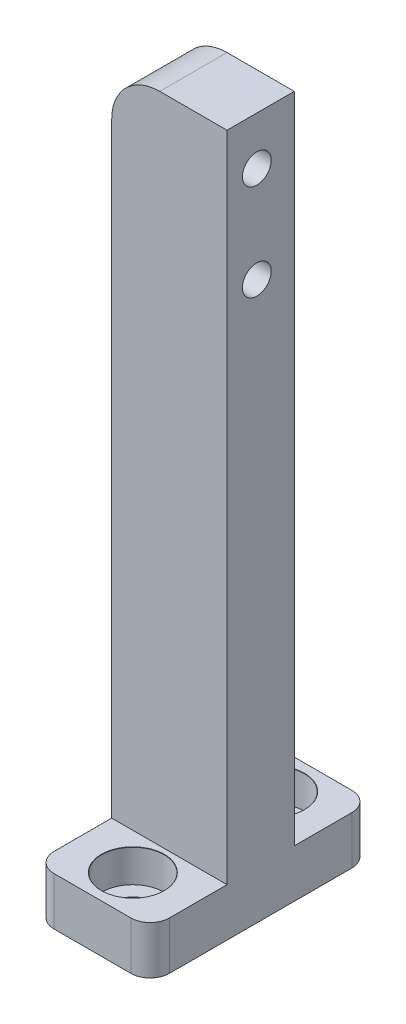
ISO-10303-21;
HEADER;
FILE_DESCRIPTION(('STEP AP214'),'2;1');
FILE_NAME('part.step','',(''),(''),'','','');
FILE_SCHEMA(('AUTOMOTIVE_DESIGN { 1 0 10303 214 1 1 1 1 }'));
ENDSEC;
DATA;
#1=APPLICATION_CONTEXT('core data for automotive mechanical design processes');
#2=APPLICATION_PROTOCOL_DEFINITION('international standard','automotive_design',2000,#1);
#3=PRODUCT_CONTEXT('',#1,'mechanical');
#4=PRODUCT('Part','Part','',(#3));
#5=PRODUCT_RELATED_PRODUCT_CATEGORY('part','',(#4));
#6=PRODUCT_DEFINITION_FORMATION('','',#4);
#7=PRODUCT_DEFINITION_CONTEXT('part definition',#1,'design');
#8=PRODUCT_DEFINITION('design','',#6,#7);
#9=PRODUCT_DEFINITION_SHAPE('','',#8);
#10=(LENGTH_UNIT() NAMED_UNIT(*) SI_UNIT(.MILLI.,.METRE.));
#11=(NAMED_UNIT(*) PLANE_ANGLE_UNIT() SI_UNIT($,.RADIAN.));
#12=(NAMED_UNIT(*) SI_UNIT($,.STERADIAN.) SOLID_ANGLE_UNIT());
#13=UNCERTAINTY_MEASURE_WITH_UNIT(LENGTH_MEASURE(1.E-05),#10,'distance_accuracy_value','');
#14=(GEOMETRIC_REPRESENTATION_CONTEXT(3) GLOBAL_UNCERTAINTY_ASSIGNED_CONTEXT((#13)) GLOBAL_UNIT_ASSIGNED_CONTEXT((#10,
#11,#12)) REPRESENTATION_CONTEXT('',''));
#15=CARTESIAN_POINT('',(0.,0.,0.));
#16=DIRECTION('',(0.,0.,1.));
#17=DIRECTION('',(1.,0.,0.));
#18=AXIS2_PLACEMENT_3D('',#15,#16,#17);
#19=CARTESIAN_POINT('',(-6.,36.5,-3.5));
#20=DIRECTION('',(0.,0.,1.));
#21=DIRECTION('',(1.,0.,0.));
#22=AXIS2_PLACEMENT_3D('',#19,#20,#21);
#23=PLANE('',#22);
#24=DIRECTION('',(0.,-1.,0.));
#25=VECTOR('',#24,1.);
#26=CARTESIAN_POINT('',(-6.,36.5,-3.5));
#27=LINE('',#26,#25);
#28=CARTESIAN_POINT('',(-6.,31.5,-3.5));
#29=VERTEX_POINT('',#28);
#30=CARTESIAN_POINT('',(-6.,-31.5,-3.5));
#31=VERTEX_POINT('',#30);
#32=EDGE_CURVE('E231',#29,#31,#27,.T.);
#33=ORIENTED_EDGE('',*,*,#32,.F.);
#34=CARTESIAN_POINT('',(-1.,31.5,-3.5));
#35=DIRECTION('',(0.,0.,1.));
#36=DIRECTION('',(1.,0.,0.));
#37=AXIS2_PLACEMENT_3D('',#34,#35,#36);
#38=CIRCLE('',#37,5.);
#39=CARTESIAN_POINT('',(-1.,36.5,-3.5));
#40=VERTEX_POINT('',#39);
#41=EDGE_CURVE('E11',#29,#40,#38,.F.);
#42=ORIENTED_EDGE('',*,*,#41,.T.);
#43=DIRECTION('',(-1.,0.,0.));
#44=VECTOR('',#43,1.);
#45=CARTESIAN_POINT('',(-6.,36.5,-3.5));
#46=LINE('',#45,#44);
#47=CARTESIAN_POINT('',(6.,36.5,-3.5));
#48=VERTEX_POINT('',#47);
#49=EDGE_CURVE('E254',#48,#40,#46,.T.);
#50=ORIENTED_EDGE('',*,*,#49,.F.);
#51=DIRECTION('',(0.,-1.,0.));
#52=VECTOR('',#51,1.);
#53=CARTESIAN_POINT('',(6.,36.5,-3.5));
#54=LINE('',#53,#52);
#55=CARTESIAN_POINT('',(6.,-31.5,-3.5));
#56=VERTEX_POINT('',#55);
#57=EDGE_CURVE('E228',#48,#56,#54,.T.);
#58=ORIENTED_EDGE('',*,*,#57,.T.);
#59=DIRECTION('',(1.,0.,0.));
#60=VECTOR('',#59,1.);
#61=CARTESIAN_POINT('',(-5.99999999999996,-31.5,-3.5));
#62=LINE('',#61,#60);
#63=EDGE_CURVE('E251',#31,#56,#62,.T.);
#64=ORIENTED_EDGE('',*,*,#63,.F.);
#65=EDGE_LOOP('',(#33,#42,#50,#58,#64));
#66=FACE_BOUND('',#65,.T.);
#67=ADVANCED_FACE('F46',(#66),#23,.F.);
#68=CARTESIAN_POINT('',(-6.,36.5,3.5));
#69=DIRECTION('',(0.,0.,-1.));
#70=DIRECTION('',(-1.,0.,0.));
#71=AXIS2_PLACEMENT_3D('',#68,#69,#70);
#72=PLANE('',#71);
#73=DIRECTION('',(1.,0.,0.));
#74=VECTOR('',#73,1.);
#75=CARTESIAN_POINT('',(-6.,36.5,3.5));
#76=LINE('',#75,#74);
#77=CARTESIAN_POINT('',(-1.,36.5,3.5));
#78=VERTEX_POINT('',#77);
#79=CARTESIAN_POINT('',(6.,36.5,3.5));
#80=VERTEX_POINT('',#79);
#81=EDGE_CURVE('E241',#78,#80,#76,.T.);
#82=ORIENTED_EDGE('',*,*,#81,.F.);
#83=CARTESIAN_POINT('',(-1.,31.5,3.5));
#84=DIRECTION('',(0.,0.,-1.));
#85=DIRECTION('',(-1.,0.,0.));
#86=AXIS2_PLACEMENT_3D('',#83,#84,#85);
#87=CIRCLE('',#86,5.);
#88=CARTESIAN_POINT('',(-6.,31.5,3.5));
#89=VERTEX_POINT('',#88);
#90=EDGE_CURVE('E160',#78,#89,#87,.F.);
#91=ORIENTED_EDGE('',*,*,#90,.T.);
#92=DIRECTION('',(0.,-1.,0.));
#93=VECTOR('',#92,1.);
#94=CARTESIAN_POINT('',(-6.,36.5,3.5));
#95=LINE('',#94,#93);
#96=CARTESIAN_POINT('',(-6.,-31.5,3.5));
#97=VERTEX_POINT('',#96);
#98=EDGE_CURVE('E234',#89,#97,#95,.T.);
#99=ORIENTED_EDGE('',*,*,#98,.T.);
#100=DIRECTION('',(-1.,0.,0.));
#101=VECTOR('',#100,1.);
#102=CARTESIAN_POINT('',(-5.99999999999996,-31.5,3.5));
#103=LINE('',#102,#101);
#104=CARTESIAN_POINT('',(6.,-31.5,3.5));
#105=VERTEX_POINT('',#104);
#106=EDGE_CURVE('E224',#105,#97,#103,.T.);
#107=ORIENTED_EDGE('',*,*,#106,.F.);
#108=DIRECTION('',(0.,-1.,0.));
#109=VECTOR('',#108,1.);
#110=CARTESIAN_POINT('',(6.,36.5,3.5));
#111=LINE('',#110,#109);
#112=EDGE_CURVE('E237',#80,#105,#111,.T.);
#113=ORIENTED_EDGE('',*,*,#112,.F.);
#114=EDGE_LOOP('',(#82,#91,#99,#107,#113));
#115=FACE_BOUND('',#114,.T.);
#116=ADVANCED_FACE('F404',(#115),#72,.F.);
#117=CARTESIAN_POINT('',(6.,36.5,3.5));
#118=DIRECTION('',(-1.,0.,0.));
#119=DIRECTION('',(0.,0.,1.));
#120=AXIS2_PLACEMENT_3D('',#117,#118,#119);
#121=PLANE('',#120);
#122=CARTESIAN_POINT('',(6.,31.5,0.4));
#123=DIRECTION('',(1.,0.,0.));
#124=DIRECTION('',(0.,0.,-1.));
#125=AXIS2_PLACEMENT_3D('',#122,#123,#124);
#126=CIRCLE('',#125,1.5);
#127=CARTESIAN_POINT('',(6.,31.5,-1.1));
#128=VERTEX_POINT('',#127);
#129=EDGE_CURVE('E150',#128,#128,#126,.T.);
#130=ORIENTED_EDGE('',*,*,#129,.F.);
#131=EDGE_LOOP('',(#130));
#132=FACE_BOUND('',#131,.T.);
#133=CARTESIAN_POINT('',(6.,21.5,0.4));
#134=DIRECTION('',(1.,0.,0.));
#135=DIRECTION('',(0.,0.,-1.));
#136=AXIS2_PLACEMENT_3D('',#133,#134,#135);
#137=CIRCLE('',#136,1.5);
#138=CARTESIAN_POINT('',(6.,21.5,-1.1));
#139=VERTEX_POINT('',#138);
#140=EDGE_CURVE('E327',#139,#139,#137,.T.);
#141=ORIENTED_EDGE('',*,*,#140,.F.);
#142=EDGE_LOOP('',(#141));
#143=FACE_BOUND('',#142,.T.);
#144=DIRECTION('',(0.,0.,-1.));
#145=VECTOR('',#144,1.);
#146=CARTESIAN_POINT('',(6.,-36.5,3.5));
#147=LINE('',#146,#145);
#148=CARTESIAN_POINT('',(6.,-36.5,9.5));
#149=VERTEX_POINT('',#148);
#150=CARTESIAN_POINT('',(6.,-36.5,-9.5));
#151=VERTEX_POINT('',#150);
#152=EDGE_CURVE('E247',#149,#151,#147,.T.);
#153=ORIENTED_EDGE('',*,*,#152,.T.);
#154=DIRECTION('',(0.,1.,0.));
#155=VECTOR('',#154,1.);
#156=CARTESIAN_POINT('',(6.,36.5,-9.5));
#157=LINE('',#156,#155);
#158=CARTESIAN_POINT('',(6.,-31.5,-9.5));
#159=VERTEX_POINT('',#158);
#160=EDGE_CURVE('E186',#151,#159,#157,.T.);
#161=ORIENTED_EDGE('',*,*,#160,.T.);
#162=DIRECTION('',(0.,0.,-1.));
#163=VECTOR('',#162,1.);
#164=CARTESIAN_POINT('',(6.,-31.5,11.5));
#165=LINE('',#164,#163);
#166=EDGE_CURVE('E267',#56,#159,#165,.T.);
#167=ORIENTED_EDGE('',*,*,#166,.F.);
#168=ORIENTED_EDGE('',*,*,#57,.F.);
#169=DIRECTION('',(0.,0.,-1.));
#170=VECTOR('',#169,1.);
#171=CARTESIAN_POINT('',(6.,36.5,3.5));
#172=LINE('',#171,#170);
#173=EDGE_CURVE('E246',#80,#48,#172,.T.);
#174=ORIENTED_EDGE('',*,*,#173,.F.);
#175=ORIENTED_EDGE('',*,*,#112,.T.);
#176=CARTESIAN_POINT('',(6.,-31.5,9.5));
#177=VERTEX_POINT('',#176);
#178=EDGE_CURVE('E264',#177,#105,#165,.T.);
#179=ORIENTED_EDGE('',*,*,#178,.F.);
#180=DIRECTION('',(0.,1.,0.));
#181=VECTOR('',#180,1.);
#182=CARTESIAN_POINT('',(6.,-36.5,9.5));
#183=LINE('',#182,#181);
#184=EDGE_CURVE('E190',#177,#149,#183,.F.);
#185=ORIENTED_EDGE('',*,*,#184,.T.);
#186=EDGE_LOOP('',(#153,#161,#167,#168,#174,#175,#179,#185));
#187=FACE_BOUND('',#186,.T.);
#188=ADVANCED_FACE('F407',(#132,#143,#187),#121,.F.);
#189=CARTESIAN_POINT('',(-6.,36.5,3.5));
#190=DIRECTION('',(1.,0.,0.));
#191=DIRECTION('',(0.,0.,-1.));
#192=AXIS2_PLACEMENT_3D('',#189,#190,#191);
#193=PLANE('',#192);
#194=CARTESIAN_POINT('',(-6.,21.5,0.4));
#195=DIRECTION('',(1.,0.,0.));
#196=DIRECTION('',(0.,0.,-1.));
#197=AXIS2_PLACEMENT_3D('',#194,#195,#196);
#198=CIRCLE('',#197,1.5);
#199=CARTESIAN_POINT('',(-6.,21.5,-1.1));
#200=VERTEX_POINT('',#199);
#201=EDGE_CURVE('E330',#200,#200,#198,.F.);
#202=ORIENTED_EDGE('',*,*,#201,.F.);
#203=EDGE_LOOP('',(#202));
#204=FACE_BOUND('',#203,.T.);
#205=DIRECTION('',(0.,0.,1.));
#206=VECTOR('',#205,1.);
#207=CARTESIAN_POINT('',(-6.,31.5,3.5));
#208=LINE('',#207,#206);
#209=CARTESIAN_POINT('',(-6.,31.5,1.9));
#210=VERTEX_POINT('',#209);
#211=EDGE_CURVE('E55',#89,#210,#208,.F.);
#212=ORIENTED_EDGE('',*,*,#211,.T.);
#213=CARTESIAN_POINT('',(-6.,31.5,0.4));
#214=DIRECTION('',(1.,0.,0.));
#215=DIRECTION('',(0.,0.,-1.));
#216=AXIS2_PLACEMENT_3D('',#213,#214,#215);
#217=CIRCLE('',#216,1.5);
#218=CARTESIAN_POINT('',(-6.,31.5,-1.1));
#219=VERTEX_POINT('',#218);
#220=EDGE_CURVE('E61',#219,#210,#217,.F.);
#221=ORIENTED_EDGE('',*,*,#220,.F.);
#222=EDGE_CURVE('E68',#219,#29,#208,.F.);
#223=ORIENTED_EDGE('',*,*,#222,.T.);
#224=ORIENTED_EDGE('',*,*,#32,.T.);
#225=DIRECTION('',(0.,0.,-1.));
#226=VECTOR('',#225,1.);
#227=CARTESIAN_POINT('',(-6.,-31.5,11.5));
#228=LINE('',#227,#226);
#229=CARTESIAN_POINT('',(-6.,-31.5,-9.5));
#230=VERTEX_POINT('',#229);
#231=EDGE_CURVE('E272',#31,#230,#228,.T.);
#232=ORIENTED_EDGE('',*,*,#231,.T.);
#233=DIRECTION('',(0.,-1.,0.));
#234=VECTOR('',#233,1.);
#235=CARTESIAN_POINT('',(-6.,36.5,-9.5));
#236=LINE('',#235,#234);
#237=CARTESIAN_POINT('',(-6.,-36.5,-9.5));
#238=VERTEX_POINT('',#237);
#239=EDGE_CURVE('E217',#230,#238,#236,.T.);
#240=ORIENTED_EDGE('',*,*,#239,.T.);
#241=DIRECTION('',(0.,0.,1.));
#242=VECTOR('',#241,1.);
#243=CARTESIAN_POINT('',(-6.,-36.5,3.5));
#244=LINE('',#243,#242);
#245=CARTESIAN_POINT('',(-6.,-36.5,9.5));
#246=VERTEX_POINT('',#245);
#247=EDGE_CURVE('E242',#238,#246,#244,.T.);
#248=ORIENTED_EDGE('',*,*,#247,.T.);
#249=DIRECTION('',(0.,-1.,0.));
#250=VECTOR('',#249,1.);
#251=CARTESIAN_POINT('',(-6.,-31.5,9.5));
#252=LINE('',#251,#250);
#253=CARTESIAN_POINT('',(-6.,-31.5,9.5));
#254=VERTEX_POINT('',#253);
#255=EDGE_CURVE('E221',#246,#254,#252,.F.);
#256=ORIENTED_EDGE('',*,*,#255,.T.);
#257=EDGE_CURVE('E268',#254,#97,#228,.T.);
#258=ORIENTED_EDGE('',*,*,#257,.T.);
#259=ORIENTED_EDGE('',*,*,#98,.F.);
#260=EDGE_LOOP('',(#212,#221,#223,#224,#232,#240,#248,#256,#258,#259));
#261=FACE_BOUND('',#260,.T.);
#262=ADVANCED_FACE('F152',(#204,#261),#193,.F.);
#263=CARTESIAN_POINT('',(0.,36.5,0.));
#264=DIRECTION('',(0.,-1.,0.));
#265=DIRECTION('',(0.,0.,-1.));
#266=AXIS2_PLACEMENT_3D('',#263,#264,#265);
#267=PLANE('',#266);
#268=ORIENTED_EDGE('',*,*,#49,.T.);
#269=DIRECTION('',(0.,0.,1.));
#270=VECTOR('',#269,1.);
#271=CARTESIAN_POINT('',(-1.,36.5,0.));
#272=LINE('',#271,#270);
#273=EDGE_CURVE('E166',#40,#78,#272,.T.);
#274=ORIENTED_EDGE('',*,*,#273,.T.);
#275=ORIENTED_EDGE('',*,*,#81,.T.);
#276=ORIENTED_EDGE('',*,*,#173,.T.);
#277=EDGE_LOOP('',(#268,#274,#275,#276));
#278=FACE_BOUND('',#277,.T.);
#279=ADVANCED_FACE('F397',(#278),#267,.F.);
#280=CARTESIAN_POINT('',(0.,-36.5,0.));
#281=DIRECTION('',(0.,-1.,0.));
#282=DIRECTION('',(0.,0.,-1.));
#283=AXIS2_PLACEMENT_3D('',#280,#281,#282);
#284=PLANE('',#283);
#285=CARTESIAN_POINT('',(0.,-36.5,7.3));
#286=DIRECTION('',(0.,1.,0.));
#287=DIRECTION('',(0.,0.,1.));
#288=AXIS2_PLACEMENT_3D('',#285,#286,#287);
#289=CIRCLE('',#288,1.7);
#290=CARTESIAN_POINT('',(0.,-36.5,9.));
#291=VERTEX_POINT('',#290);
#292=EDGE_CURVE('E308',#291,#291,#289,.T.);
#293=ORIENTED_EDGE('',*,*,#292,.T.);
#294=EDGE_LOOP('',(#293));
#295=FACE_BOUND('',#294,.T.);
#296=CARTESIAN_POINT('',(0.,-36.5,-7.3));
#297=DIRECTION('',(0.,1.,0.));
#298=DIRECTION('',(0.,0.,1.));
#299=AXIS2_PLACEMENT_3D('',#296,#297,#298);
#300=CIRCLE('',#299,1.7);
#301=CARTESIAN_POINT('',(0.,-36.5,-5.6));
#302=VERTEX_POINT('',#301);
#303=EDGE_CURVE('E282',#302,#302,#300,.T.);
#304=ORIENTED_EDGE('',*,*,#303,.T.);
#305=EDGE_LOOP('',(#304));
#306=FACE_BOUND('',#305,.T.);
#307=ORIENTED_EDGE('',*,*,#247,.F.);
#308=CARTESIAN_POINT('',(-4.,-36.5,-9.5));
#309=DIRECTION('',(0.,-1.,0.));
#310=DIRECTION('',(0.,0.,-1.));
#311=AXIS2_PLACEMENT_3D('',#308,#309,#310);
#312=CIRCLE('',#311,2.);
#313=CARTESIAN_POINT('',(-4.,-36.5,-11.5));
#314=VERTEX_POINT('',#313);
#315=EDGE_CURVE('E205',#238,#314,#312,.T.);
#316=ORIENTED_EDGE('',*,*,#315,.T.);
#317=DIRECTION('',(1.,0.,0.));
#318=VECTOR('',#317,1.);
#319=CARTESIAN_POINT('',(-6.,-36.5,-11.5));
#320=LINE('',#319,#318);
#321=CARTESIAN_POINT('',(4.,-36.5,-11.5));
#322=VERTEX_POINT('',#321);
#323=EDGE_CURVE('E278',#314,#322,#320,.T.);
#324=ORIENTED_EDGE('',*,*,#323,.T.);
#325=CARTESIAN_POINT('',(4.,-36.5,-9.5));
#326=DIRECTION('',(0.,-1.,0.));
#327=DIRECTION('',(0.,0.,-1.));
#328=AXIS2_PLACEMENT_3D('',#325,#326,#327);
#329=CIRCLE('',#328,2.);
#330=EDGE_CURVE('E208',#322,#151,#329,.T.);
#331=ORIENTED_EDGE('',*,*,#330,.T.);
#332=ORIENTED_EDGE('',*,*,#152,.F.);
#333=CARTESIAN_POINT('',(4.,-36.5,9.5));
#334=DIRECTION('',(0.,-1.,0.));
#335=DIRECTION('',(0.,0.,-1.));
#336=AXIS2_PLACEMENT_3D('',#333,#334,#335);
#337=CIRCLE('',#336,2.);
#338=CARTESIAN_POINT('',(4.,-36.5,11.5));
#339=VERTEX_POINT('',#338);
#340=EDGE_CURVE('E214',#149,#339,#337,.T.);
#341=ORIENTED_EDGE('',*,*,#340,.T.);
#342=DIRECTION('',(1.,0.,0.));
#343=VECTOR('',#342,1.);
#344=CARTESIAN_POINT('',(-6.,-36.5,11.5));
#345=LINE('',#344,#343);
#346=CARTESIAN_POINT('',(-4.,-36.5,11.5));
#347=VERTEX_POINT('',#346);
#348=EDGE_CURVE('E277',#347,#339,#345,.T.);
#349=ORIENTED_EDGE('',*,*,#348,.F.);
#350=CARTESIAN_POINT('',(-4.,-36.5,9.5));
#351=DIRECTION('',(0.,-1.,0.));
#352=DIRECTION('',(0.,0.,-1.));
#353=AXIS2_PLACEMENT_3D('',#350,#351,#352);
#354=CIRCLE('',#353,2.);
#355=EDGE_CURVE('E211',#347,#246,#354,.T.);
#356=ORIENTED_EDGE('',*,*,#355,.T.);
#357=EDGE_LOOP('',(#307,#316,#324,#331,#332,#341,#349,#356));
#358=FACE_BOUND('',#357,.T.);
#359=ADVANCED_FACE('F386',(#295,#306,#358),#284,.T.);
#360=CARTESIAN_POINT('',(0.,0.,11.5));
#361=DIRECTION('',(0.,0.,1.));
#362=DIRECTION('',(1.,0.,0.));
#363=AXIS2_PLACEMENT_3D('',#360,#361,#362);
#364=PLANE('',#363);
#365=DIRECTION('',(-1.,0.,0.));
#366=VECTOR('',#365,1.);
#367=CARTESIAN_POINT('',(-6.,-31.5,11.5));
#368=LINE('',#367,#366);
#369=CARTESIAN_POINT('',(4.,-31.5,11.5));
#370=VERTEX_POINT('',#369);
#371=CARTESIAN_POINT('',(-4.,-31.5,11.5));
#372=VERTEX_POINT('',#371);
#373=EDGE_CURVE('E283',#370,#372,#368,.T.);
#374=ORIENTED_EDGE('',*,*,#373,.T.);
#375=DIRECTION('',(0.,-1.,0.));
#376=VECTOR('',#375,1.);
#377=CARTESIAN_POINT('',(-4.,-36.5,11.5));
#378=LINE('',#377,#376);
#379=EDGE_CURVE('E178',#372,#347,#378,.T.);
#380=ORIENTED_EDGE('',*,*,#379,.T.);
#381=ORIENTED_EDGE('',*,*,#348,.T.);
#382=DIRECTION('',(0.,1.,0.));
#383=VECTOR('',#382,1.);
#384=CARTESIAN_POINT('',(4.,-31.5,11.5));
#385=LINE('',#384,#383);
#386=EDGE_CURVE('E182',#339,#370,#385,.T.);
#387=ORIENTED_EDGE('',*,*,#386,.T.);
#388=EDGE_LOOP('',(#374,#380,#381,#387));
#389=FACE_BOUND('',#388,.T.);
#390=ADVANCED_FACE('F382',(#389),#364,.T.);
#391=CARTESIAN_POINT('',(-6.,-31.5,11.5));
#392=DIRECTION('',(0.,-1.,0.));
#393=DIRECTION('',(1.,0.,0.));
#394=AXIS2_PLACEMENT_3D('',#391,#392,#393);
#395=PLANE('',#394);
#396=CARTESIAN_POINT('',(0.,-31.5,7.3));
#397=DIRECTION('',(0.,1.,0.));
#398=DIRECTION('',(0.,0.,1.));
#399=AXIS2_PLACEMENT_3D('',#396,#397,#398);
#400=CIRCLE('',#399,3.275);
#401=CARTESIAN_POINT('',(0.,-31.5,10.575));
#402=VERTEX_POINT('',#401);
#403=EDGE_CURVE('E155',#402,#402,#400,.T.);
#404=ORIENTED_EDGE('',*,*,#403,.F.);
#405=EDGE_LOOP('',(#404));
#406=FACE_BOUND('',#405,.T.);
#407=ORIENTED_EDGE('',*,*,#257,.F.);
#408=CARTESIAN_POINT('',(-4.,-31.5,9.5));
#409=DIRECTION('',(0.,-1.,0.));
#410=DIRECTION('',(1.,0.,0.));
#411=AXIS2_PLACEMENT_3D('',#408,#409,#410);
#412=CIRCLE('',#411,2.);
#413=EDGE_CURVE('E172',#254,#372,#412,.F.);
#414=ORIENTED_EDGE('',*,*,#413,.T.);
#415=ORIENTED_EDGE('',*,*,#373,.F.);
#416=CARTESIAN_POINT('',(4.,-31.5,9.5));
#417=DIRECTION('',(0.,-1.,0.));
#418=DIRECTION('',(1.,0.,0.));
#419=AXIS2_PLACEMENT_3D('',#416,#417,#418);
#420=CIRCLE('',#419,2.);
#421=EDGE_CURVE('E175',#370,#177,#420,.F.);
#422=ORIENTED_EDGE('',*,*,#421,.T.);
#423=ORIENTED_EDGE('',*,*,#178,.T.);
#424=ORIENTED_EDGE('',*,*,#106,.T.);
#425=EDGE_LOOP('',(#407,#414,#415,#422,#423,#424));
#426=FACE_BOUND('',#425,.T.);
#427=ADVANCED_FACE('F385',(#406,#426),#395,.F.);
#428=CARTESIAN_POINT('',(0.,-31.5,-7.3));
#429=DIRECTION('',(0.,1.,0.));
#430=DIRECTION('',(0.,0.,1.));
#431=AXIS2_PLACEMENT_3D('',#428,#429,#430);
#432=CIRCLE('',#431,3.275);
#433=CARTESIAN_POINT('',(0.,-31.5,-4.025));
#434=VERTEX_POINT('',#433);
#435=EDGE_CURVE('E304',#434,#434,#432,.T.);
#436=ORIENTED_EDGE('',*,*,#435,.F.);
#437=EDGE_LOOP('',(#436));
#438=FACE_BOUND('',#437,.T.);
#439=DIRECTION('',(-1.,0.,0.));
#440=VECTOR('',#439,1.);
#441=CARTESIAN_POINT('',(-6.,-31.5,-11.5));
#442=LINE('',#441,#440);
#443=CARTESIAN_POINT('',(4.,-31.5,-11.5));
#444=VERTEX_POINT('',#443);
#445=CARTESIAN_POINT('',(-4.,-31.5,-11.5));
#446=VERTEX_POINT('',#445);
#447=EDGE_CURVE('E273',#444,#446,#442,.T.);
#448=ORIENTED_EDGE('',*,*,#447,.T.);
#449=CARTESIAN_POINT('',(-4.,-31.5,-9.5));
#450=DIRECTION('',(0.,-1.,0.));
#451=DIRECTION('',(1.,0.,0.));
#452=AXIS2_PLACEMENT_3D('',#449,#450,#451);
#453=CIRCLE('',#452,2.);
#454=EDGE_CURVE('E193',#446,#230,#453,.F.);
#455=ORIENTED_EDGE('',*,*,#454,.T.);
#456=ORIENTED_EDGE('',*,*,#231,.F.);
#457=ORIENTED_EDGE('',*,*,#63,.T.);
#458=ORIENTED_EDGE('',*,*,#166,.T.);
#459=CARTESIAN_POINT('',(4.,-31.5,-9.5));
#460=DIRECTION('',(0.,-1.,0.));
#461=DIRECTION('',(1.,0.,0.));
#462=AXIS2_PLACEMENT_3D('',#459,#460,#461);
#463=CIRCLE('',#462,2.);
#464=EDGE_CURVE('E196',#159,#444,#463,.F.);
#465=ORIENTED_EDGE('',*,*,#464,.T.);
#466=EDGE_LOOP('',(#448,#455,#456,#457,#458,#465));
#467=FACE_BOUND('',#466,.T.);
#468=ADVANCED_FACE('F392',(#438,#467),#395,.F.);
#469=CARTESIAN_POINT('',(0.,0.,-11.5));
#470=DIRECTION('',(0.,0.,1.));
#471=DIRECTION('',(1.,0.,0.));
#472=AXIS2_PLACEMENT_3D('',#469,#470,#471);
#473=PLANE('',#472);
#474=ORIENTED_EDGE('',*,*,#323,.F.);
#475=DIRECTION('',(0.,-1.,0.));
#476=VECTOR('',#475,1.);
#477=CARTESIAN_POINT('',(-4.,0.,-11.5));
#478=LINE('',#477,#476);
#479=EDGE_CURVE('E199',#314,#446,#478,.F.);
#480=ORIENTED_EDGE('',*,*,#479,.T.);
#481=ORIENTED_EDGE('',*,*,#447,.F.);
#482=DIRECTION('',(0.,1.,0.));
#483=VECTOR('',#482,1.);
#484=CARTESIAN_POINT('',(4.,0.,-11.5));
#485=LINE('',#484,#483);
#486=EDGE_CURVE('E202',#444,#322,#485,.F.);
#487=ORIENTED_EDGE('',*,*,#486,.T.);
#488=EDGE_LOOP('',(#474,#480,#481,#487));
#489=FACE_BOUND('',#488,.T.);
#490=ADVANCED_FACE('F388',(#489),#473,.F.);
#491=CARTESIAN_POINT('',(-4.,36.5,-9.5));
#492=DIRECTION('',(0.,-1.,0.));
#493=DIRECTION('',(0.,0.,-1.));
#494=AXIS2_PLACEMENT_3D('',#491,#492,#493);
#495=CYLINDRICAL_SURFACE('',#494,2.);
#496=ORIENTED_EDGE('',*,*,#454,.F.);
#497=ORIENTED_EDGE('',*,*,#479,.F.);
#498=ORIENTED_EDGE('',*,*,#315,.F.);
#499=ORIENTED_EDGE('',*,*,#239,.F.);
#500=EDGE_LOOP('',(#496,#497,#498,#499));
#501=FACE_BOUND('',#500,.T.);
#502=ADVANCED_FACE('F391',(#501),#495,.T.);
#503=CARTESIAN_POINT('',(4.,36.5,-9.5));
#504=DIRECTION('',(0.,1.,0.));
#505=DIRECTION('',(0.,0.,1.));
#506=AXIS2_PLACEMENT_3D('',#503,#504,#505);
#507=CYLINDRICAL_SURFACE('',#506,2.);
#508=ORIENTED_EDGE('',*,*,#330,.F.);
#509=ORIENTED_EDGE('',*,*,#486,.F.);
#510=ORIENTED_EDGE('',*,*,#464,.F.);
#511=ORIENTED_EDGE('',*,*,#160,.F.);
#512=EDGE_LOOP('',(#508,#509,#510,#511));
#513=FACE_BOUND('',#512,.T.);
#514=ADVANCED_FACE('F420',(#513),#507,.T.);
#515=CARTESIAN_POINT('',(-4.,0.,9.5));
#516=DIRECTION('',(0.,1.,0.));
#517=DIRECTION('',(0.,0.,1.));
#518=AXIS2_PLACEMENT_3D('',#515,#516,#517);
#519=CYLINDRICAL_SURFACE('',#518,2.);
#520=ORIENTED_EDGE('',*,*,#413,.F.);
#521=ORIENTED_EDGE('',*,*,#255,.F.);
#522=ORIENTED_EDGE('',*,*,#355,.F.);
#523=ORIENTED_EDGE('',*,*,#379,.F.);
#524=EDGE_LOOP('',(#520,#521,#522,#523));
#525=FACE_BOUND('',#524,.T.);
#526=ADVANCED_FACE('F424',(#525),#519,.T.);
#527=CARTESIAN_POINT('',(4.,0.,9.5));
#528=DIRECTION('',(0.,-1.,0.));
#529=DIRECTION('',(0.,0.,-1.));
#530=AXIS2_PLACEMENT_3D('',#527,#528,#529);
#531=CYLINDRICAL_SURFACE('',#530,2.);
#532=ORIENTED_EDGE('',*,*,#340,.F.);
#533=ORIENTED_EDGE('',*,*,#184,.F.);
#534=ORIENTED_EDGE('',*,*,#421,.F.);
#535=ORIENTED_EDGE('',*,*,#386,.F.);
#536=EDGE_LOOP('',(#532,#533,#534,#535));
#537=FACE_BOUND('',#536,.T.);
#538=ADVANCED_FACE('F380',(#537),#531,.T.);
#539=CARTESIAN_POINT('',(0.,-31.5,-7.3));
#540=DIRECTION('',(0.,1.,0.));
#541=DIRECTION('',(0.,0.,1.));
#542=AXIS2_PLACEMENT_3D('',#539,#540,#541);
#543=CYLINDRICAL_SURFACE('',#542,1.7);
#544=ORIENTED_EDGE('',*,*,#303,.F.);
#545=EDGE_LOOP('',(#544));
#546=FACE_BOUND('',#545,.T.);
#547=CARTESIAN_POINT('',(0.,-34.9,-7.3));
#548=DIRECTION('',(0.,1.,0.));
#549=DIRECTION('',(0.,0.,1.));
#550=AXIS2_PLACEMENT_3D('',#547,#548,#549);
#551=CIRCLE('',#550,1.7);
#552=CARTESIAN_POINT('',(0.,-34.9,-5.6));
#553=VERTEX_POINT('',#552);
#554=EDGE_CURVE('E292',#553,#553,#551,.T.);
#555=ORIENTED_EDGE('',*,*,#554,.T.);
#556=EDGE_LOOP('',(#555));
#557=FACE_BOUND('',#556,.T.);
#558=ADVANCED_FACE('F376',(#546,#557),#543,.F.);
#559=CARTESIAN_POINT('',(3.25000000000002,-34.9,-7.3));
#560=DIRECTION('',(0.,-1.,0.));
#561=DIRECTION('',(0.,0.,-1.));
#562=AXIS2_PLACEMENT_3D('',#559,#560,#561);
#563=PLANE('',#562);
#564=ORIENTED_EDGE('',*,*,#554,.F.);
#565=EDGE_LOOP('',(#564));
#566=FACE_BOUND('',#565,.T.);
#567=CARTESIAN_POINT('',(0.,-34.9,-7.3));
#568=DIRECTION('',(0.,1.,0.));
#569=DIRECTION('',(0.,0.,1.));
#570=AXIS2_PLACEMENT_3D('',#567,#568,#569);
#571=CIRCLE('',#570,3.25);
#572=CARTESIAN_POINT('',(0.,-34.9,-4.05));
#573=VERTEX_POINT('',#572);
#574=EDGE_CURVE('E296',#573,#573,#571,.T.);
#575=ORIENTED_EDGE('',*,*,#574,.T.);
#576=EDGE_LOOP('',(#575));
#577=FACE_BOUND('',#576,.T.);
#578=ADVANCED_FACE('F372',(#566,#577),#563,.F.);
#579=CARTESIAN_POINT('',(0.,-31.5,-7.3));
#580=DIRECTION('',(0.,1.,0.));
#581=DIRECTION('',(0.,0.,1.));
#582=AXIS2_PLACEMENT_3D('',#579,#580,#581);
#583=CYLINDRICAL_SURFACE('',#582,3.25);
#584=ORIENTED_EDGE('',*,*,#574,.F.);
#585=EDGE_LOOP('',(#584));
#586=FACE_BOUND('',#585,.T.);
#587=CARTESIAN_POINT('',(0.,-31.525,-7.3));
#588=DIRECTION('',(0.,1.,0.));
#589=DIRECTION('',(0.,0.,1.));
#590=AXIS2_PLACEMENT_3D('',#587,#588,#589);
#591=CIRCLE('',#590,3.25);
#592=CARTESIAN_POINT('',(0.,-31.525,-4.05));
#593=VERTEX_POINT('',#592);
#594=EDGE_CURVE('E300',#593,#593,#591,.T.);
#595=ORIENTED_EDGE('',*,*,#594,.T.);
#596=EDGE_LOOP('',(#595));
#597=FACE_BOUND('',#596,.T.);
#598=ADVANCED_FACE('F368',(#586,#597),#583,.F.);
#599=CARTESIAN_POINT('',(0.,-31.5,-7.3));
#600=DIRECTION('',(0.,1.,0.));
#601=DIRECTION('',(0.,0.,1.));
#602=AXIS2_PLACEMENT_3D('',#599,#600,#601);
#603=CONICAL_SURFACE('',#602,3.275,0.785398163397518);
#604=ORIENTED_EDGE('',*,*,#594,.F.);
#605=EDGE_LOOP('',(#604));
#606=FACE_BOUND('',#605,.T.);
#607=ORIENTED_EDGE('',*,*,#435,.T.);
#608=EDGE_LOOP('',(#607));
#609=FACE_BOUND('',#608,.T.);
#610=ADVANCED_FACE('F364',(#606,#609),#603,.F.);
#611=CARTESIAN_POINT('',(0.,-31.5,7.3));
#612=DIRECTION('',(0.,1.,0.));
#613=DIRECTION('',(0.,0.,1.));
#614=AXIS2_PLACEMENT_3D('',#611,#612,#613);
#615=CYLINDRICAL_SURFACE('',#614,1.7);
#616=ORIENTED_EDGE('',*,*,#292,.F.);
#617=EDGE_LOOP('',(#616));
#618=FACE_BOUND('',#617,.T.);
#619=CARTESIAN_POINT('',(0.,-34.9,7.3));
#620=DIRECTION('',(0.,1.,0.));
#621=DIRECTION('',(0.,0.,1.));
#622=AXIS2_PLACEMENT_3D('',#619,#620,#621);
#623=CIRCLE('',#622,1.7);
#624=CARTESIAN_POINT('',(0.,-34.9,9.));
#625=VERTEX_POINT('',#624);
#626=EDGE_CURVE('E312',#625,#625,#623,.T.);
#627=ORIENTED_EDGE('',*,*,#626,.T.);
#628=EDGE_LOOP('',(#627));
#629=FACE_BOUND('',#628,.T.);
#630=ADVANCED_FACE('F360',(#618,#629),#615,.F.);
#631=CARTESIAN_POINT('',(3.25000000000002,-34.9,7.3));
#632=DIRECTION('',(0.,-1.,0.));
#633=DIRECTION('',(0.,0.,-1.));
#634=AXIS2_PLACEMENT_3D('',#631,#632,#633);
#635=PLANE('',#634);
#636=ORIENTED_EDGE('',*,*,#626,.F.);
#637=EDGE_LOOP('',(#636));
#638=FACE_BOUND('',#637,.T.);
#639=CARTESIAN_POINT('',(0.,-34.9,7.3));
#640=DIRECTION('',(0.,1.,0.));
#641=DIRECTION('',(0.,0.,1.));
#642=AXIS2_PLACEMENT_3D('',#639,#640,#641);
#643=CIRCLE('',#642,3.25);
#644=CARTESIAN_POINT('',(0.,-34.9,10.55));
#645=VERTEX_POINT('',#644);
#646=EDGE_CURVE('E316',#645,#645,#643,.T.);
#647=ORIENTED_EDGE('',*,*,#646,.T.);
#648=EDGE_LOOP('',(#647));
#649=FACE_BOUND('',#648,.T.);
#650=ADVANCED_FACE('F356',(#638,#649),#635,.F.);
#651=CARTESIAN_POINT('',(0.,-31.5,7.3));
#652=DIRECTION('',(0.,1.,0.));
#653=DIRECTION('',(0.,0.,1.));
#654=AXIS2_PLACEMENT_3D('',#651,#652,#653);
#655=CYLINDRICAL_SURFACE('',#654,3.25);
#656=ORIENTED_EDGE('',*,*,#646,.F.);
#657=EDGE_LOOP('',(#656));
#658=FACE_BOUND('',#657,.T.);
#659=CARTESIAN_POINT('',(0.,-31.525,7.3));
#660=DIRECTION('',(0.,1.,0.));
#661=DIRECTION('',(0.,0.,1.));
#662=AXIS2_PLACEMENT_3D('',#659,#660,#661);
#663=CIRCLE('',#662,3.25);
#664=CARTESIAN_POINT('',(0.,-31.525,10.55));
#665=VERTEX_POINT('',#664);
#666=EDGE_CURVE('E320',#665,#665,#663,.T.);
#667=ORIENTED_EDGE('',*,*,#666,.T.);
#668=EDGE_LOOP('',(#667));
#669=FACE_BOUND('',#668,.T.);
#670=ADVANCED_FACE('F352',(#658,#669),#655,.F.);
#671=CARTESIAN_POINT('',(0.,-31.5,7.3));
#672=DIRECTION('',(0.,1.,0.));
#673=DIRECTION('',(0.,0.,1.));
#674=AXIS2_PLACEMENT_3D('',#671,#672,#673);
#675=CONICAL_SURFACE('',#674,3.275,0.785398163397518);
#676=ORIENTED_EDGE('',*,*,#666,.F.);
#677=EDGE_LOOP('',(#676));
#678=FACE_BOUND('',#677,.T.);
#679=ORIENTED_EDGE('',*,*,#403,.T.);
#680=EDGE_LOOP('',(#679));
#681=FACE_BOUND('',#680,.T.);
#682=ADVANCED_FACE('F349',(#678,#681),#675,.F.);
#683=CARTESIAN_POINT('',(-1.,31.5,0.));
#684=DIRECTION('',(0.,0.,1.));
#685=DIRECTION('',(1.,0.,0.));
#686=AXIS2_PLACEMENT_3D('',#683,#684,#685);
#687=CYLINDRICAL_SURFACE('',#686,5.);
#688=CARTESIAN_POINT('',(-6.,31.5,-1.1));
#689=CARTESIAN_POINT('',(-6.00000277540116,31.5412216851379,-1.10000074088228));
#690=CARTESIAN_POINT('',(-5.99948961836044,31.5824227723611,-1.09829967584819));
#691=CARTESIAN_POINT('',(-5.99746104814917,31.6645131970998,-1.09152015595064));
#692=CARTESIAN_POINT('',(-5.99594583377207,31.7054025948229,-1.08644237097768));
#693=CARTESIAN_POINT('',(-5.98995421258275,31.8269578970226,-1.06622618623275));
#694=CARTESIAN_POINT('',(-5.98403144129011,31.9067825362229,-1.04610455372686));
#695=CARTESIAN_POINT('',(-5.96895666939261,32.0617357443794,-0.99325670100849));
#696=CARTESIAN_POINT('',(-5.95980542419465,32.136865407042,-0.96053342919717));
#697=CARTESIAN_POINT('',(-5.93922400356688,32.2806029056603,-0.883475569174473));
#698=CARTESIAN_POINT('',(-5.92779293781697,32.3492081781914,-0.839136442588399));
#699=CARTESIAN_POINT('',(-5.90350773366123,32.4798709030833,-0.738777381874356));
#700=CARTESIAN_POINT('',(-5.89062457585254,32.5417148050816,-0.682486575472648));
#701=CARTESIAN_POINT('',(-5.86505906394763,32.6552459876862,-0.560394545800001));
#702=CARTESIAN_POINT('',(-5.85237675569745,32.7069309792808,-0.494591184938008));
#703=CARTESIAN_POINT('',(-5.82834085702409,32.799801548353,-0.353527575608336));
#704=CARTESIAN_POINT('',(-5.81702353912299,32.8407250209213,-0.278088010815733));
#705=CARTESIAN_POINT('',(-5.79743581611077,32.9092152178897,-0.121006933559127));
#706=CARTESIAN_POINT('',(-5.78916453790634,32.9367857703828,-0.0393672063673191));
#707=CARTESIAN_POINT('',(-5.77690877406439,32.9770161266059,0.12538938571458));
#708=CARTESIAN_POINT('',(-5.77281078115892,32.9900716823,0.208400945692347));
#709=CARTESIAN_POINT('',(-5.76902789155249,33.0021373248312,0.375531335315362));
#710=CARTESIAN_POINT('',(-5.76934202073304,33.0011505119741,0.459649916452651));
#711=CARTESIAN_POINT('',(-5.77424745373487,32.9854697317424,0.623384348908582));
#712=CARTESIAN_POINT('',(-5.77868393486783,32.9712719020863,0.703053121928061));
#713=CARTESIAN_POINT('',(-5.79108364901659,32.9303739073488,0.858820618871474));
#714=CARTESIAN_POINT('',(-5.79904719164088,32.9036726446935,0.934919028737176));
#715=CARTESIAN_POINT('',(-5.81772739367134,32.8381600664014,1.08260084349301));
#716=CARTESIAN_POINT('',(-5.82848030540671,32.7991877230494,1.15410803358654));
#717=CARTESIAN_POINT('',(-5.85151003381557,32.7103514842924,1.28973288579314));
#718=CARTESIAN_POINT('',(-5.86378719924559,32.6604850942874,1.35384885026273));
#719=CARTESIAN_POINT('',(-5.88910888214206,32.5488186325644,1.47568024023528));
#720=CARTESIAN_POINT('',(-5.90216405760601,32.4866078830836,1.5330176421046));
#721=CARTESIAN_POINT('',(-5.92712015117901,32.3532757925806,1.63654519931824));
#722=CARTESIAN_POINT('',(-5.93902077572235,32.2821521957842,1.68273252397136));
#723=CARTESIAN_POINT('',(-5.96043803707882,32.1323143053728,1.762883646878));
#724=CARTESIAN_POINT('',(-5.96993688960351,32.0535490389824,1.7967570280326));
#725=CARTESIAN_POINT('',(-5.98534218707386,31.8911300657569,1.85062447982789));
#726=CARTESIAN_POINT('',(-5.99125388779918,31.8074837086215,1.87063886233264));
#727=CARTESIAN_POINT('',(-5.99668121948922,31.6858837291754,1.88890712015452));
#728=CARTESIAN_POINT('',(-5.99792349194399,31.648811461833,1.89306666526517));
#729=CARTESIAN_POINT('',(-5.99958281890525,31.5744990174066,1.89861053003616));
#730=CARTESIAN_POINT('',(-6.00000113900092,31.5372591860344,1.89999910594286));
#731=CARTESIAN_POINT('',(-6.00000000000002,31.5,1.90000000000005));
#732=B_SPLINE_CURVE_WITH_KNOTS('',3,(#688,#689,#690,#691,#692,#693,#694,#695,#696,#697,#698,
#699,#700,#701,#702,#703,#704,#705,#706,#707,#708,#709,#710,#711,#712,#713,#714,#715,#716,#717,
#718,#719,#720,#721,#722,#723,#724,#725,#726,#727,#728,#729,#730,#731),.UNSPECIFIED.,.F.,.F.,(4,
2,2,2,2,2,2,2,2,2,2,2,2,2,2,2,2,2,2,2,2,4),(0.,0.123586349299509,0.247148188235251,
0.493467705903285,0.739729627259746,0.98608790829237,1.23877657706038,1.49152211668281,
1.74994856887333,2.00830088994153,2.25942192987994,2.5104875276088,2.75248923057988,
2.99451218087958,3.2398536437702,3.48525134577321,3.74087441324127,3.99656230813591,
4.25409142087119,4.51124229334192,4.62312535209809,4.73483642426842),.UNSPECIFIED.);
#733=EDGE_CURVE('E144',#219,#210,#732,.T.);
#734=ORIENTED_EDGE('',*,*,#733,.T.);
#735=ORIENTED_EDGE('',*,*,#211,.F.);
#736=ORIENTED_EDGE('',*,*,#90,.F.);
#737=ORIENTED_EDGE('',*,*,#273,.F.);
#738=ORIENTED_EDGE('',*,*,#41,.F.);
#739=ORIENTED_EDGE('',*,*,#222,.F.);
#740=EDGE_LOOP('',(#734,#735,#736,#737,#738,#739));
#741=FACE_BOUND('',#740,.T.);
#742=ADVANCED_FACE('F48',(#741),#687,.T.);
#743=CARTESIAN_POINT('',(-6.001,31.5,0.4));
#744=DIRECTION('',(1.,0.,0.));
#745=DIRECTION('',(0.,0.,-1.));
#746=AXIS2_PLACEMENT_3D('',#743,#744,#745);
#747=CYLINDRICAL_SURFACE('',#746,1.5);
#748=ORIENTED_EDGE('',*,*,#129,.T.);
#749=EDGE_LOOP('',(#748));
#750=FACE_BOUND('',#749,.T.);
#751=ORIENTED_EDGE('',*,*,#220,.T.);
#752=ORIENTED_EDGE('',*,*,#733,.F.);
#753=EDGE_LOOP('',(#751,#752));
#754=FACE_BOUND('',#753,.T.);
#755=ADVANCED_FACE('F145',(#750,#754),#747,.F.);
#756=CARTESIAN_POINT('',(-6.001,21.5,0.4));
#757=DIRECTION('',(1.,0.,0.));
#758=DIRECTION('',(0.,0.,-1.));
#759=AXIS2_PLACEMENT_3D('',#756,#757,#758);
#760=CYLINDRICAL_SURFACE('',#759,1.5);
#761=ORIENTED_EDGE('',*,*,#140,.T.);
#762=EDGE_LOOP('',(#761));
#763=FACE_BOUND('',#762,.T.);
#764=ORIENTED_EDGE('',*,*,#201,.T.);
#765=EDGE_LOOP('',(#764));
#766=FACE_BOUND('',#765,.T.);
#767=ADVANCED_FACE('F344',(#763,#766),#760,.F.);
#768=CLOSED_SHELL('',(#67,#116,#188,#262,#279,#359,#390,#427,#468,#490,#502,#514,#526,#538,#558,
#578,#598,#610,#630,#650,#670,#682,#742,#755,#767));
#769=MANIFOLD_SOLID_BREP('B2',#768);
#770=ADVANCED_BREP_SHAPE_REPRESENTATION('',(#18,#769),#14);
#771=SHAPE_DEFINITION_REPRESENTATION(#9,#770);
ENDSEC;
END-ISO-10303-21;
